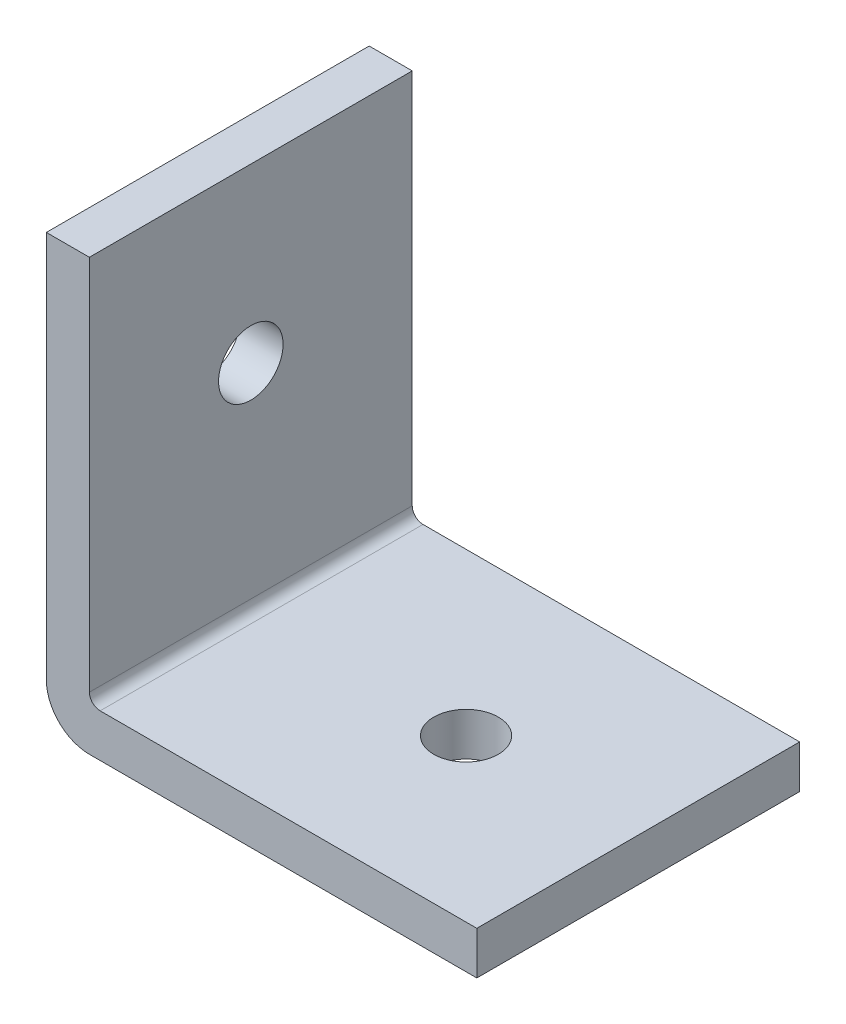
ISO-10303-21;
HEADER;
FILE_DESCRIPTION(('STEP AP214'),'2;1');
FILE_NAME('part.step','',(''),(''),'','','');
FILE_SCHEMA(('AUTOMOTIVE_DESIGN { 1 0 10303 214 1 1 1 1 }'));
ENDSEC;
DATA;
#1=APPLICATION_CONTEXT('core data for automotive mechanical design processes');
#2=APPLICATION_PROTOCOL_DEFINITION('international standard','automotive_design',2000,#1);
#3=PRODUCT_CONTEXT('',#1,'mechanical');
#4=PRODUCT('Part','Part','',(#3));
#5=PRODUCT_RELATED_PRODUCT_CATEGORY('part','',(#4));
#6=PRODUCT_DEFINITION_FORMATION('','',#4);
#7=PRODUCT_DEFINITION_CONTEXT('part definition',#1,'design');
#8=PRODUCT_DEFINITION('design','',#6,#7);
#9=PRODUCT_DEFINITION_SHAPE('','',#8);
#10=(LENGTH_UNIT() NAMED_UNIT(*) SI_UNIT(.MILLI.,.METRE.));
#11=(NAMED_UNIT(*) PLANE_ANGLE_UNIT() SI_UNIT($,.RADIAN.));
#12=(NAMED_UNIT(*) SI_UNIT($,.STERADIAN.) SOLID_ANGLE_UNIT());
#13=UNCERTAINTY_MEASURE_WITH_UNIT(LENGTH_MEASURE(1.E-05),#10,'distance_accuracy_value','');
#14=(GEOMETRIC_REPRESENTATION_CONTEXT(3) GLOBAL_UNCERTAINTY_ASSIGNED_CONTEXT((#13)) GLOBAL_UNIT_ASSIGNED_CONTEXT((#10,
#11,#12)) REPRESENTATION_CONTEXT('',''));
#15=CARTESIAN_POINT('',(0.,0.,0.));
#16=DIRECTION('',(0.,0.,1.));
#17=DIRECTION('',(1.,0.,0.));
#18=AXIS2_PLACEMENT_3D('',#15,#16,#17);
#19=CARTESIAN_POINT('',(0.,20.,15.));
#20=DIRECTION('',(0.,-1.,0.));
#21=DIRECTION('',(0.,0.,-1.));
#22=AXIS2_PLACEMENT_3D('',#19,#20,#21);
#23=PLANE('',#22);
#24=DIRECTION('',(-1.,0.,0.));
#25=VECTOR('',#24,1.);
#26=CARTESIAN_POINT('',(0.,20.,0.));
#27=LINE('',#26,#25);
#28=CARTESIAN_POINT('',(2.,20.,0.));
#29=VERTEX_POINT('',#28);
#30=CARTESIAN_POINT('',(0.,20.,0.));
#31=VERTEX_POINT('',#30);
#32=EDGE_CURVE('E140',#29,#31,#27,.T.);
#33=ORIENTED_EDGE('',*,*,#32,.T.);
#34=DIRECTION('',(0.,0.,-1.));
#35=VECTOR('',#34,1.);
#36=CARTESIAN_POINT('',(0.,20.,15.));
#37=LINE('',#36,#35);
#38=CARTESIAN_POINT('',(0.,20.,15.));
#39=VERTEX_POINT('',#38);
#40=EDGE_CURVE('E11',#39,#31,#37,.T.);
#41=ORIENTED_EDGE('',*,*,#40,.F.);
#42=DIRECTION('',(-1.,0.,0.));
#43=VECTOR('',#42,1.);
#44=CARTESIAN_POINT('',(0.,20.,15.));
#45=LINE('',#44,#43);
#46=CARTESIAN_POINT('',(2.,20.,15.));
#47=VERTEX_POINT('',#46);
#48=EDGE_CURVE('E163',#47,#39,#45,.T.);
#49=ORIENTED_EDGE('',*,*,#48,.F.);
#50=DIRECTION('',(0.,0.,-1.));
#51=VECTOR('',#50,1.);
#52=CARTESIAN_POINT('',(2.,20.,15.));
#53=LINE('',#52,#51);
#54=EDGE_CURVE('E136',#47,#29,#53,.T.);
#55=ORIENTED_EDGE('',*,*,#54,.T.);
#56=EDGE_LOOP('',(#33,#41,#49,#55));
#57=FACE_BOUND('',#56,.T.);
#58=ADVANCED_FACE('F39',(#57),#23,.F.);
#59=CARTESIAN_POINT('',(0.,2.00000000000001,15.));
#60=DIRECTION('',(1.,0.,0.));
#61=DIRECTION('',(0.,1.,0.));
#62=AXIS2_PLACEMENT_3D('',#59,#60,#61);
#63=PLANE('',#62);
#64=CARTESIAN_POINT('',(0.,12.,7.5));
#65=DIRECTION('',(1.,0.,0.));
#66=DIRECTION('',(0.,1.,0.));
#67=AXIS2_PLACEMENT_3D('',#64,#65,#66);
#68=CIRCLE('',#67,1.5);
#69=CARTESIAN_POINT('',(0.,13.5,7.5));
#70=VERTEX_POINT('',#69);
#71=EDGE_CURVE('E211',#70,#70,#68,.T.);
#72=ORIENTED_EDGE('',*,*,#71,.T.);
#73=EDGE_LOOP('',(#72));
#74=FACE_BOUND('',#73,.T.);
#75=DIRECTION('',(0.,-1.,0.));
#76=VECTOR('',#75,1.);
#77=CARTESIAN_POINT('',(0.,2.00000000000001,0.));
#78=LINE('',#77,#76);
#79=CARTESIAN_POINT('',(0.,2.00000000000001,0.));
#80=VERTEX_POINT('',#79);
#81=EDGE_CURVE('E144',#31,#80,#78,.T.);
#82=ORIENTED_EDGE('',*,*,#81,.T.);
#83=DIRECTION('',(0.,0.,-1.));
#84=VECTOR('',#83,1.);
#85=CARTESIAN_POINT('',(0.,2.00000000000001,15.));
#86=LINE('',#85,#84);
#87=CARTESIAN_POINT('',(0.,2.00000000000001,15.));
#88=VERTEX_POINT('',#87);
#89=EDGE_CURVE('E48',#88,#80,#86,.T.);
#90=ORIENTED_EDGE('',*,*,#89,.F.);
#91=DIRECTION('',(0.,-1.,0.));
#92=VECTOR('',#91,1.);
#93=CARTESIAN_POINT('',(0.,2.00000000000001,15.));
#94=LINE('',#93,#92);
#95=EDGE_CURVE('E99',#39,#88,#94,.T.);
#96=ORIENTED_EDGE('',*,*,#95,.F.);
#97=ORIENTED_EDGE('',*,*,#40,.T.);
#98=EDGE_LOOP('',(#82,#90,#96,#97));
#99=FACE_BOUND('',#98,.T.);
#100=ADVANCED_FACE('F223',(#74,#99),#63,.F.);
#101=CARTESIAN_POINT('',(2.,2.,15.));
#102=DIRECTION('',(0.,0.,-1.));
#103=DIRECTION('',(-1.,0.,0.));
#104=AXIS2_PLACEMENT_3D('',#101,#102,#103);
#105=CYLINDRICAL_SURFACE('',#104,2.);
#106=CARTESIAN_POINT('',(2.,2.,0.));
#107=DIRECTION('',(0.,0.,1.));
#108=DIRECTION('',(1.,0.,0.));
#109=AXIS2_PLACEMENT_3D('',#106,#107,#108);
#110=CIRCLE('',#109,2.);
#111=CARTESIAN_POINT('',(2.00000000000001,0.,0.));
#112=VERTEX_POINT('',#111);
#113=EDGE_CURVE('E148',#80,#112,#110,.T.);
#114=ORIENTED_EDGE('',*,*,#113,.T.);
#115=DIRECTION('',(0.,0.,-1.));
#116=VECTOR('',#115,1.);
#117=CARTESIAN_POINT('',(2.00000000000001,0.,15.));
#118=LINE('',#117,#116);
#119=CARTESIAN_POINT('',(2.00000000000001,0.,15.));
#120=VERTEX_POINT('',#119);
#121=EDGE_CURVE('E174',#120,#112,#118,.T.);
#122=ORIENTED_EDGE('',*,*,#121,.F.);
#123=CARTESIAN_POINT('',(2.,2.,15.));
#124=DIRECTION('',(0.,0.,1.));
#125=DIRECTION('',(1.,0.,0.));
#126=AXIS2_PLACEMENT_3D('',#123,#124,#125);
#127=CIRCLE('',#126,2.);
#128=EDGE_CURVE('E184',#88,#120,#127,.T.);
#129=ORIENTED_EDGE('',*,*,#128,.F.);
#130=ORIENTED_EDGE('',*,*,#89,.T.);
#131=EDGE_LOOP('',(#114,#122,#129,#130));
#132=FACE_BOUND('',#131,.T.);
#133=ADVANCED_FACE('F182',(#132),#105,.T.);
#134=CARTESIAN_POINT('',(20.,0.,15.));
#135=DIRECTION('',(0.,1.,0.));
#136=DIRECTION('',(-1.,0.,0.));
#137=AXIS2_PLACEMENT_3D('',#134,#135,#136);
#138=PLANE('',#137);
#139=CARTESIAN_POINT('',(12.,0.,7.5));
#140=DIRECTION('',(0.,1.,0.));
#141=DIRECTION('',(-1.,0.,0.));
#142=AXIS2_PLACEMENT_3D('',#139,#140,#141);
#143=CIRCLE('',#142,1.5);
#144=CARTESIAN_POINT('',(10.5,0.,7.5));
#145=VERTEX_POINT('',#144);
#146=EDGE_CURVE('E145',#145,#145,#143,.T.);
#147=ORIENTED_EDGE('',*,*,#146,.T.);
#148=EDGE_LOOP('',(#147));
#149=FACE_BOUND('',#148,.T.);
#150=DIRECTION('',(1.,0.,0.));
#151=VECTOR('',#150,1.);
#152=CARTESIAN_POINT('',(20.,0.,0.));
#153=LINE('',#152,#151);
#154=CARTESIAN_POINT('',(20.,0.,0.));
#155=VERTEX_POINT('',#154);
#156=EDGE_CURVE('E151',#112,#155,#153,.T.);
#157=ORIENTED_EDGE('',*,*,#156,.T.);
#158=DIRECTION('',(0.,0.,-1.));
#159=VECTOR('',#158,1.);
#160=CARTESIAN_POINT('',(20.,0.,15.));
#161=LINE('',#160,#159);
#162=CARTESIAN_POINT('',(20.,0.,15.));
#163=VERTEX_POINT('',#162);
#164=EDGE_CURVE('E170',#163,#155,#161,.T.);
#165=ORIENTED_EDGE('',*,*,#164,.F.);
#166=DIRECTION('',(1.,0.,0.));
#167=VECTOR('',#166,1.);
#168=CARTESIAN_POINT('',(20.,0.,15.));
#169=LINE('',#168,#167);
#170=EDGE_CURVE('E197',#120,#163,#169,.T.);
#171=ORIENTED_EDGE('',*,*,#170,.F.);
#172=ORIENTED_EDGE('',*,*,#121,.T.);
#173=EDGE_LOOP('',(#157,#165,#171,#172));
#174=FACE_BOUND('',#173,.T.);
#175=ADVANCED_FACE('F192',(#149,#174),#138,.F.);
#176=CARTESIAN_POINT('',(20.,2.,15.));
#177=DIRECTION('',(-1.,0.,0.));
#178=DIRECTION('',(0.,0.,1.));
#179=AXIS2_PLACEMENT_3D('',#176,#177,#178);
#180=PLANE('',#179);
#181=DIRECTION('',(0.,1.,0.));
#182=VECTOR('',#181,1.);
#183=CARTESIAN_POINT('',(20.,2.,0.));
#184=LINE('',#183,#182);
#185=CARTESIAN_POINT('',(20.,2.,0.));
#186=VERTEX_POINT('',#185);
#187=EDGE_CURVE('E154',#155,#186,#184,.T.);
#188=ORIENTED_EDGE('',*,*,#187,.T.);
#189=DIRECTION('',(0.,0.,-1.));
#190=VECTOR('',#189,1.);
#191=CARTESIAN_POINT('',(20.,2.,15.));
#192=LINE('',#191,#190);
#193=CARTESIAN_POINT('',(20.,2.,15.));
#194=VERTEX_POINT('',#193);
#195=EDGE_CURVE('E129',#194,#186,#192,.T.);
#196=ORIENTED_EDGE('',*,*,#195,.F.);
#197=DIRECTION('',(0.,1.,0.));
#198=VECTOR('',#197,1.);
#199=CARTESIAN_POINT('',(20.,2.,15.));
#200=LINE('',#199,#198);
#201=EDGE_CURVE('E118',#163,#194,#200,.T.);
#202=ORIENTED_EDGE('',*,*,#201,.F.);
#203=ORIENTED_EDGE('',*,*,#164,.T.);
#204=EDGE_LOOP('',(#188,#196,#202,#203));
#205=FACE_BOUND('',#204,.T.);
#206=ADVANCED_FACE('F195',(#205),#180,.F.);
#207=CARTESIAN_POINT('',(2.50000000000001,2.,15.));
#208=DIRECTION('',(0.,-1.,0.));
#209=DIRECTION('',(0.,0.,-1.));
#210=AXIS2_PLACEMENT_3D('',#207,#208,#209);
#211=PLANE('',#210);
#212=CARTESIAN_POINT('',(12.,2.,7.5));
#213=DIRECTION('',(0.,1.,0.));
#214=DIRECTION('',(-1.,0.,0.));
#215=AXIS2_PLACEMENT_3D('',#212,#213,#214);
#216=CIRCLE('',#215,1.5);
#217=CARTESIAN_POINT('',(10.5,2.,7.5));
#218=VERTEX_POINT('',#217);
#219=EDGE_CURVE('E207',#218,#218,#216,.T.);
#220=ORIENTED_EDGE('',*,*,#219,.F.);
#221=EDGE_LOOP('',(#220));
#222=FACE_BOUND('',#221,.T.);
#223=DIRECTION('',(-1.,0.,0.));
#224=VECTOR('',#223,1.);
#225=CARTESIAN_POINT('',(2.50000000000001,2.,0.));
#226=LINE('',#225,#224);
#227=CARTESIAN_POINT('',(2.50000000000001,2.,0.));
#228=VERTEX_POINT('',#227);
#229=EDGE_CURVE('E127',#186,#228,#226,.T.);
#230=ORIENTED_EDGE('',*,*,#229,.T.);
#231=DIRECTION('',(0.,0.,-1.));
#232=VECTOR('',#231,1.);
#233=CARTESIAN_POINT('',(2.50000000000001,2.,15.));
#234=LINE('',#233,#232);
#235=CARTESIAN_POINT('',(2.50000000000001,2.,15.));
#236=VERTEX_POINT('',#235);
#237=EDGE_CURVE('E124',#236,#228,#234,.T.);
#238=ORIENTED_EDGE('',*,*,#237,.F.);
#239=DIRECTION('',(-1.,0.,0.));
#240=VECTOR('',#239,1.);
#241=CARTESIAN_POINT('',(2.50000000000001,2.,15.));
#242=LINE('',#241,#240);
#243=EDGE_CURVE('E112',#194,#236,#242,.T.);
#244=ORIENTED_EDGE('',*,*,#243,.F.);
#245=ORIENTED_EDGE('',*,*,#195,.T.);
#246=EDGE_LOOP('',(#230,#238,#244,#245));
#247=FACE_BOUND('',#246,.T.);
#248=ADVANCED_FACE('F125',(#222,#247),#211,.F.);
#249=CARTESIAN_POINT('',(2.5,2.5,15.));
#250=DIRECTION('',(0.,0.,-1.));
#251=DIRECTION('',(-1.,0.,0.));
#252=AXIS2_PLACEMENT_3D('',#249,#250,#251);
#253=CYLINDRICAL_SURFACE('',#252,0.5);
#254=CARTESIAN_POINT('',(2.5,2.5,0.));
#255=DIRECTION('',(0.,0.,-1.));
#256=DIRECTION('',(-1.,0.,0.));
#257=AXIS2_PLACEMENT_3D('',#254,#255,#256);
#258=CIRCLE('',#257,0.5);
#259=CARTESIAN_POINT('',(2.,2.5,0.));
#260=VERTEX_POINT('',#259);
#261=EDGE_CURVE('E85',#228,#260,#258,.T.);
#262=ORIENTED_EDGE('',*,*,#261,.T.);
#263=DIRECTION('',(0.,0.,-1.));
#264=VECTOR('',#263,1.);
#265=CARTESIAN_POINT('',(2.,2.5,15.));
#266=LINE('',#265,#264);
#267=CARTESIAN_POINT('',(2.,2.5,15.));
#268=VERTEX_POINT('',#267);
#269=EDGE_CURVE('E130',#268,#260,#266,.T.);
#270=ORIENTED_EDGE('',*,*,#269,.F.);
#271=CARTESIAN_POINT('',(2.5,2.5,15.));
#272=DIRECTION('',(0.,0.,-1.));
#273=DIRECTION('',(-1.,0.,0.));
#274=AXIS2_PLACEMENT_3D('',#271,#272,#273);
#275=CIRCLE('',#274,0.5);
#276=EDGE_CURVE('E116',#236,#268,#275,.T.);
#277=ORIENTED_EDGE('',*,*,#276,.F.);
#278=ORIENTED_EDGE('',*,*,#237,.T.);
#279=EDGE_LOOP('',(#262,#270,#277,#278));
#280=FACE_BOUND('',#279,.T.);
#281=ADVANCED_FACE('F132',(#280),#253,.F.);
#282=CARTESIAN_POINT('',(2.,20.,15.));
#283=DIRECTION('',(-1.,0.,0.));
#284=DIRECTION('',(0.,-1.,0.));
#285=AXIS2_PLACEMENT_3D('',#282,#283,#284);
#286=PLANE('',#285);
#287=CARTESIAN_POINT('',(2.,12.,7.5));
#288=DIRECTION('',(1.,0.,0.));
#289=DIRECTION('',(0.,1.,0.));
#290=AXIS2_PLACEMENT_3D('',#287,#288,#289);
#291=CIRCLE('',#290,1.5);
#292=CARTESIAN_POINT('',(2.,13.5,7.5));
#293=VERTEX_POINT('',#292);
#294=EDGE_CURVE('E215',#293,#293,#291,.T.);
#295=ORIENTED_EDGE('',*,*,#294,.F.);
#296=EDGE_LOOP('',(#295));
#297=FACE_BOUND('',#296,.T.);
#298=DIRECTION('',(0.,1.,0.));
#299=VECTOR('',#298,1.);
#300=CARTESIAN_POINT('',(2.,20.,0.));
#301=LINE('',#300,#299);
#302=EDGE_CURVE('E91',#260,#29,#301,.T.);
#303=ORIENTED_EDGE('',*,*,#302,.T.);
#304=ORIENTED_EDGE('',*,*,#54,.F.);
#305=DIRECTION('',(0.,1.,0.));
#306=VECTOR('',#305,1.);
#307=CARTESIAN_POINT('',(2.,20.,15.));
#308=LINE('',#307,#306);
#309=EDGE_CURVE('E56',#268,#47,#308,.T.);
#310=ORIENTED_EDGE('',*,*,#309,.F.);
#311=ORIENTED_EDGE('',*,*,#269,.T.);
#312=EDGE_LOOP('',(#303,#304,#310,#311));
#313=FACE_BOUND('',#312,.T.);
#314=ADVANCED_FACE('F232',(#297,#313),#286,.F.);
#315=CARTESIAN_POINT('',(2.5,2.5,15.));
#316=DIRECTION('',(0.,0.,-1.));
#317=DIRECTION('',(-1.,0.,0.));
#318=AXIS2_PLACEMENT_3D('',#315,#316,#317);
#319=PLANE('',#318);
#320=ORIENTED_EDGE('',*,*,#48,.T.);
#321=ORIENTED_EDGE('',*,*,#95,.T.);
#322=ORIENTED_EDGE('',*,*,#128,.T.);
#323=ORIENTED_EDGE('',*,*,#170,.T.);
#324=ORIENTED_EDGE('',*,*,#201,.T.);
#325=ORIENTED_EDGE('',*,*,#243,.T.);
#326=ORIENTED_EDGE('',*,*,#276,.T.);
#327=ORIENTED_EDGE('',*,*,#309,.T.);
#328=EDGE_LOOP('',(#320,#321,#322,#323,#324,#325,#326,#327));
#329=FACE_BOUND('',#328,.T.);
#330=ADVANCED_FACE('F114',(#329),#319,.F.);
#331=CARTESIAN_POINT('',(2.5,2.5,0.));
#332=DIRECTION('',(0.,0.,-1.));
#333=DIRECTION('',(-1.,0.,0.));
#334=AXIS2_PLACEMENT_3D('',#331,#332,#333);
#335=PLANE('',#334);
#336=ORIENTED_EDGE('',*,*,#32,.F.);
#337=ORIENTED_EDGE('',*,*,#302,.F.);
#338=ORIENTED_EDGE('',*,*,#261,.F.);
#339=ORIENTED_EDGE('',*,*,#229,.F.);
#340=ORIENTED_EDGE('',*,*,#187,.F.);
#341=ORIENTED_EDGE('',*,*,#156,.F.);
#342=ORIENTED_EDGE('',*,*,#113,.F.);
#343=ORIENTED_EDGE('',*,*,#81,.F.);
#344=EDGE_LOOP('',(#336,#337,#338,#339,#340,#341,#342,#343));
#345=FACE_BOUND('',#344,.T.);
#346=ADVANCED_FACE('F188',(#345),#335,.T.);
#347=CARTESIAN_POINT('',(12.,0.,7.5));
#348=DIRECTION('',(0.,1.,0.));
#349=DIRECTION('',(-1.,0.,0.));
#350=AXIS2_PLACEMENT_3D('',#347,#348,#349);
#351=CYLINDRICAL_SURFACE('',#350,1.5);
#352=ORIENTED_EDGE('',*,*,#146,.F.);
#353=EDGE_LOOP('',(#352));
#354=FACE_BOUND('',#353,.T.);
#355=ORIENTED_EDGE('',*,*,#219,.T.);
#356=EDGE_LOOP('',(#355));
#357=FACE_BOUND('',#356,.T.);
#358=ADVANCED_FACE('F228',(#354,#357),#351,.F.);
#359=CARTESIAN_POINT('',(0.,12.,7.5));
#360=DIRECTION('',(1.,0.,0.));
#361=DIRECTION('',(0.,1.,0.));
#362=AXIS2_PLACEMENT_3D('',#359,#360,#361);
#363=CYLINDRICAL_SURFACE('',#362,1.5);
#364=ORIENTED_EDGE('',*,*,#71,.F.);
#365=EDGE_LOOP('',(#364));
#366=FACE_BOUND('',#365,.T.);
#367=ORIENTED_EDGE('',*,*,#294,.T.);
#368=EDGE_LOOP('',(#367));
#369=FACE_BOUND('',#368,.T.);
#370=ADVANCED_FACE('F225',(#366,#369),#363,.F.);
#371=CLOSED_SHELL('',(#58,#100,#133,#175,#206,#248,#281,#314,#330,#346,#358,#370));
#372=MANIFOLD_SOLID_BREP('B2',#371);
#373=ADVANCED_BREP_SHAPE_REPRESENTATION('',(#18,#372),#14);
#374=SHAPE_DEFINITION_REPRESENTATION(#9,#373);
ENDSEC;
END-ISO-10303-21;
